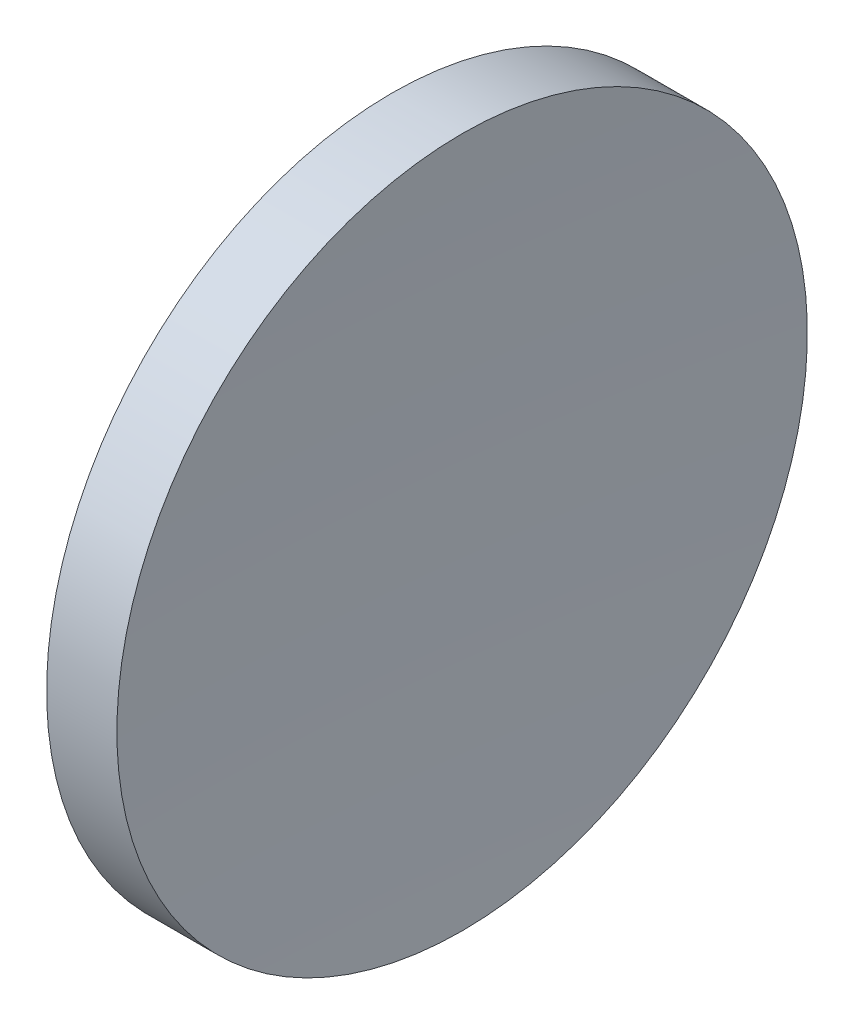
ISO-10303-21;
HEADER;
FILE_DESCRIPTION(('STEP AP214'),'2;1');
FILE_NAME('part.step','',(''),(''),'','','');
FILE_SCHEMA(('AUTOMOTIVE_DESIGN { 1 0 10303 214 1 1 1 1 }'));
ENDSEC;
DATA;
#1=APPLICATION_CONTEXT('core data for automotive mechanical design processes');
#2=APPLICATION_PROTOCOL_DEFINITION('international standard','automotive_design',2000,#1);
#3=PRODUCT_CONTEXT('',#1,'mechanical');
#4=PRODUCT('Part','Part','',(#3));
#5=PRODUCT_RELATED_PRODUCT_CATEGORY('part','',(#4));
#6=PRODUCT_DEFINITION_FORMATION('','',#4);
#7=PRODUCT_DEFINITION_CONTEXT('part definition',#1,'design');
#8=PRODUCT_DEFINITION('design','',#6,#7);
#9=PRODUCT_DEFINITION_SHAPE('','',#8);
#10=(LENGTH_UNIT() NAMED_UNIT(*) SI_UNIT(.MILLI.,.METRE.));
#11=(NAMED_UNIT(*) PLANE_ANGLE_UNIT() SI_UNIT($,.RADIAN.));
#12=(NAMED_UNIT(*) SI_UNIT($,.STERADIAN.) SOLID_ANGLE_UNIT());
#13=UNCERTAINTY_MEASURE_WITH_UNIT(LENGTH_MEASURE(1.E-05),#10,'distance_accuracy_value','');
#14=(GEOMETRIC_REPRESENTATION_CONTEXT(3) GLOBAL_UNCERTAINTY_ASSIGNED_CONTEXT((#13)) GLOBAL_UNIT_ASSIGNED_CONTEXT((#10,
#11,#12)) REPRESENTATION_CONTEXT('',''));
#15=CARTESIAN_POINT('',(0.,0.,0.));
#16=DIRECTION('',(0.,0.,1.));
#17=DIRECTION('',(1.,0.,0.));
#18=AXIS2_PLACEMENT_3D('',#15,#16,#17);
#19=CARTESIAN_POINT('',(211.612193698495,65.2168404709403,0.));
#20=DIRECTION('',(-1.,0.,0.));
#21=DIRECTION('',(0.,1.,0.));
#22=AXIS2_PLACEMENT_3D('',#19,#20,#21);
#23=SPHERICAL_SURFACE('',#22,89.);
#24=CARTESIAN_POINT('',(123.494374842148,65.2168404709403,0.));
#25=DIRECTION('',(-1.,0.,0.));
#26=DIRECTION('',(0.,-1.,0.));
#27=AXIS2_PLACEMENT_3D('',#24,#25,#26);
#28=CIRCLE('',#27,12.5);
#29=CARTESIAN_POINT('',(123.494374842148,52.7168404709403,0.));
#30=VERTEX_POINT('',#29);
#31=EDGE_CURVE('E41',#30,#30,#28,.T.);
#32=ORIENTED_EDGE('',*,*,#31,.T.);
#33=EDGE_LOOP('',(#32));
#34=FACE_BOUND('',#33,.T.);
#35=ADVANCED_FACE('F35',(#34),#23,.T.);
#36=CARTESIAN_POINT('',(365.712193698495,65.2168404709401,0.));
#37=DIRECTION('',(-1.,0.,0.));
#38=DIRECTION('',(0.,1.,0.));
#39=AXIS2_PLACEMENT_3D('',#36,#37,#38);
#40=SPHERICAL_SURFACE('',#39,240.);
#41=CARTESIAN_POINT('',(126.037935589702,65.2168404709403,0.));
#42=DIRECTION('',(-1.,0.,0.));
#43=DIRECTION('',(0.,-1.,0.));
#44=AXIS2_PLACEMENT_3D('',#41,#42,#43);
#45=CIRCLE('',#44,12.5);
#46=CARTESIAN_POINT('',(126.037935589702,52.7168404709403,0.));
#47=VERTEX_POINT('',#46);
#48=EDGE_CURVE('E10',#47,#47,#45,.T.);
#49=ORIENTED_EDGE('',*,*,#48,.F.);
#50=EDGE_LOOP('',(#49));
#51=FACE_BOUND('',#50,.T.);
#52=ADVANCED_FACE('F50',(#51),#40,.F.);
#53=CARTESIAN_POINT('',(115.944491297963,65.2168404709403,0.));
#54=DIRECTION('',(-1.,0.,0.));
#55=DIRECTION('',(0.,-1.,0.));
#56=AXIS2_PLACEMENT_3D('',#53,#54,#55);
#57=CYLINDRICAL_SURFACE('',#56,12.5);
#58=ORIENTED_EDGE('',*,*,#31,.F.);
#59=EDGE_LOOP('',(#58));
#60=FACE_BOUND('',#59,.T.);
#61=ORIENTED_EDGE('',*,*,#48,.T.);
#62=EDGE_LOOP('',(#61));
#63=FACE_BOUND('',#62,.T.);
#64=ADVANCED_FACE('F48',(#60,#63),#57,.T.);
#65=CLOSED_SHELL('',(#35,#52,#64));
#66=MANIFOLD_SOLID_BREP('B2',#65);
#67=ADVANCED_BREP_SHAPE_REPRESENTATION('',(#18,#66),#14);
#68=SHAPE_DEFINITION_REPRESENTATION(#9,#67);
ENDSEC;
END-ISO-10303-21;
